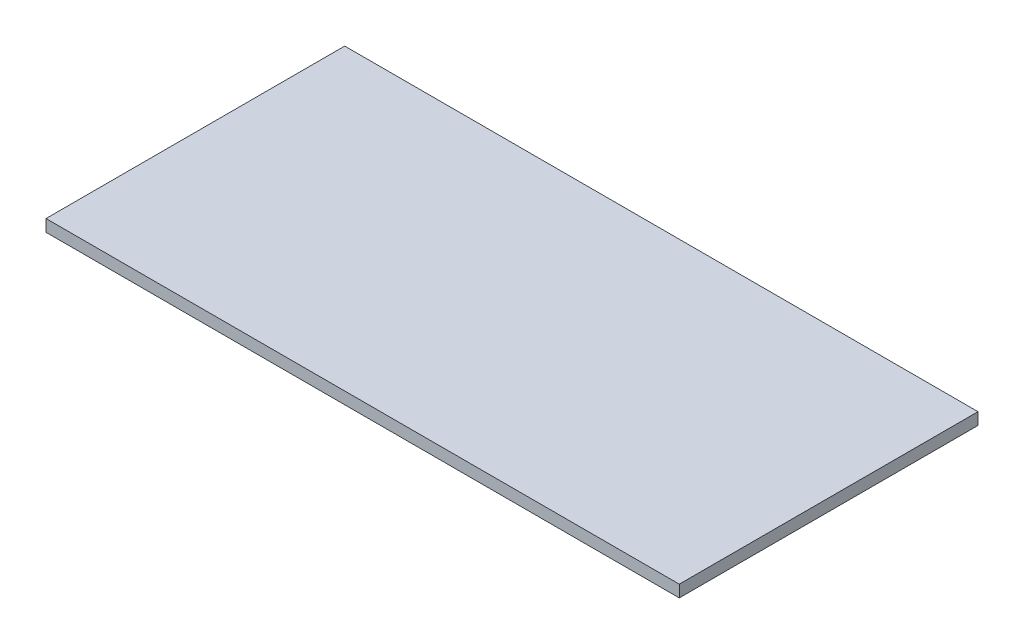
ISO-10303-21;
HEADER;
FILE_DESCRIPTION(('STEP AP214'),'2;1');
FILE_NAME('part.step','',(''),(''),'','','');
FILE_SCHEMA(('AUTOMOTIVE_DESIGN { 1 0 10303 214 1 1 1 1 }'));
ENDSEC;
DATA;
#1=APPLICATION_CONTEXT('core data for automotive mechanical design processes');
#2=APPLICATION_PROTOCOL_DEFINITION('international standard','automotive_design',2000,#1);
#3=PRODUCT_CONTEXT('',#1,'mechanical');
#4=PRODUCT('Part','Part','',(#3));
#5=PRODUCT_RELATED_PRODUCT_CATEGORY('part','',(#4));
#6=PRODUCT_DEFINITION_FORMATION('','',#4);
#7=PRODUCT_DEFINITION_CONTEXT('part definition',#1,'design');
#8=PRODUCT_DEFINITION('design','',#6,#7);
#9=PRODUCT_DEFINITION_SHAPE('','',#8);
#10=(LENGTH_UNIT() NAMED_UNIT(*) SI_UNIT(.MILLI.,.METRE.));
#11=(NAMED_UNIT(*) PLANE_ANGLE_UNIT() SI_UNIT($,.RADIAN.));
#12=(NAMED_UNIT(*) SI_UNIT($,.STERADIAN.) SOLID_ANGLE_UNIT());
#13=UNCERTAINTY_MEASURE_WITH_UNIT(LENGTH_MEASURE(1.E-05),#10,'distance_accuracy_value','');
#14=(GEOMETRIC_REPRESENTATION_CONTEXT(3) GLOBAL_UNCERTAINTY_ASSIGNED_CONTEXT((#13)) GLOBAL_UNIT_ASSIGNED_CONTEXT((#10,
#11,#12)) REPRESENTATION_CONTEXT('',''));
#15=CARTESIAN_POINT('',(0.,0.,0.));
#16=DIRECTION('',(0.,0.,1.));
#17=DIRECTION('',(1.,0.,0.));
#18=AXIS2_PLACEMENT_3D('',#15,#16,#17);
#19=CARTESIAN_POINT('',(-26.5,1.,0.));
#20=DIRECTION('',(1.,0.,0.));
#21=DIRECTION('',(0.,0.,-1.));
#22=AXIS2_PLACEMENT_3D('',#19,#20,#21);
#23=PLANE('',#22);
#24=DIRECTION('',(0.,0.,1.));
#25=VECTOR('',#24,1.);
#26=CARTESIAN_POINT('',(-26.5,0.,0.));
#27=LINE('',#26,#25);
#28=CARTESIAN_POINT('',(-26.5,0.,0.));
#29=VERTEX_POINT('',#28);
#30=CARTESIAN_POINT('',(-26.5,0.,25.));
#31=VERTEX_POINT('',#30);
#32=EDGE_CURVE('E96',#29,#31,#27,.T.);
#33=ORIENTED_EDGE('',*,*,#32,.T.);
#34=DIRECTION('',(0.,-1.,0.));
#35=VECTOR('',#34,1.);
#36=CARTESIAN_POINT('',(-26.5,1.,25.));
#37=LINE('',#36,#35);
#38=CARTESIAN_POINT('',(-26.5,1.,25.));
#39=VERTEX_POINT('',#38);
#40=EDGE_CURVE('E11',#39,#31,#37,.T.);
#41=ORIENTED_EDGE('',*,*,#40,.F.);
#42=DIRECTION('',(0.,0.,1.));
#43=VECTOR('',#42,1.);
#44=CARTESIAN_POINT('',(-26.5,1.,0.));
#45=LINE('',#44,#43);
#46=CARTESIAN_POINT('',(-26.5,1.,0.));
#47=VERTEX_POINT('',#46);
#48=EDGE_CURVE('E84',#47,#39,#45,.T.);
#49=ORIENTED_EDGE('',*,*,#48,.F.);
#50=DIRECTION('',(0.,-1.,0.));
#51=VECTOR('',#50,1.);
#52=CARTESIAN_POINT('',(-26.5,1.,0.));
#53=LINE('',#52,#51);
#54=EDGE_CURVE('E92',#47,#29,#53,.T.);
#55=ORIENTED_EDGE('',*,*,#54,.T.);
#56=EDGE_LOOP('',(#33,#41,#49,#55));
#57=FACE_BOUND('',#56,.T.);
#58=ADVANCED_FACE('F33',(#57),#23,.F.);
#59=CARTESIAN_POINT('',(-26.5,1.,25.));
#60=DIRECTION('',(0.,0.,-1.));
#61=DIRECTION('',(-1.,0.,0.));
#62=AXIS2_PLACEMENT_3D('',#59,#60,#61);
#63=PLANE('',#62);
#64=DIRECTION('',(1.,0.,0.));
#65=VECTOR('',#64,1.);
#66=CARTESIAN_POINT('',(-26.5,0.,25.));
#67=LINE('',#66,#65);
#68=CARTESIAN_POINT('',(26.5,0.,25.));
#69=VERTEX_POINT('',#68);
#70=EDGE_CURVE('E88',#31,#69,#67,.T.);
#71=ORIENTED_EDGE('',*,*,#70,.T.);
#72=DIRECTION('',(0.,-1.,0.));
#73=VECTOR('',#72,1.);
#74=CARTESIAN_POINT('',(26.5,1.,25.));
#75=LINE('',#74,#73);
#76=CARTESIAN_POINT('',(26.5,1.,25.));
#77=VERTEX_POINT('',#76);
#78=EDGE_CURVE('E41',#77,#69,#75,.T.);
#79=ORIENTED_EDGE('',*,*,#78,.F.);
#80=DIRECTION('',(1.,0.,0.));
#81=VECTOR('',#80,1.);
#82=CARTESIAN_POINT('',(-26.5,1.,25.));
#83=LINE('',#82,#81);
#84=EDGE_CURVE('E79',#39,#77,#83,.T.);
#85=ORIENTED_EDGE('',*,*,#84,.F.);
#86=ORIENTED_EDGE('',*,*,#40,.T.);
#87=EDGE_LOOP('',(#71,#79,#85,#86));
#88=FACE_BOUND('',#87,.T.);
#89=ADVANCED_FACE('F87',(#88),#63,.F.);
#90=CARTESIAN_POINT('',(26.5,1.,0.));
#91=DIRECTION('',(-1.,0.,0.));
#92=DIRECTION('',(0.,0.,1.));
#93=AXIS2_PLACEMENT_3D('',#90,#91,#92);
#94=PLANE('',#93);
#95=DIRECTION('',(0.,0.,-1.));
#96=VECTOR('',#95,1.);
#97=CARTESIAN_POINT('',(26.5,0.,0.));
#98=LINE('',#97,#96);
#99=CARTESIAN_POINT('',(26.5,0.,0.));
#100=VERTEX_POINT('',#99);
#101=EDGE_CURVE('E66',#69,#100,#98,.T.);
#102=ORIENTED_EDGE('',*,*,#101,.T.);
#103=DIRECTION('',(0.,-1.,0.));
#104=VECTOR('',#103,1.);
#105=CARTESIAN_POINT('',(26.5,1.,0.));
#106=LINE('',#105,#104);
#107=CARTESIAN_POINT('',(26.5,1.,0.));
#108=VERTEX_POINT('',#107);
#109=EDGE_CURVE('E89',#108,#100,#106,.T.);
#110=ORIENTED_EDGE('',*,*,#109,.F.);
#111=DIRECTION('',(0.,0.,-1.));
#112=VECTOR('',#111,1.);
#113=CARTESIAN_POINT('',(26.5,1.,0.));
#114=LINE('',#113,#112);
#115=EDGE_CURVE('E82',#77,#108,#114,.T.);
#116=ORIENTED_EDGE('',*,*,#115,.F.);
#117=ORIENTED_EDGE('',*,*,#78,.T.);
#118=EDGE_LOOP('',(#102,#110,#116,#117));
#119=FACE_BOUND('',#118,.T.);
#120=ADVANCED_FACE('F90',(#119),#94,.F.);
#121=CARTESIAN_POINT('',(-26.5,1.,0.));
#122=DIRECTION('',(0.,0.,1.));
#123=DIRECTION('',(1.,0.,0.));
#124=AXIS2_PLACEMENT_3D('',#121,#122,#123);
#125=PLANE('',#124);
#126=DIRECTION('',(-1.,0.,0.));
#127=VECTOR('',#126,1.);
#128=CARTESIAN_POINT('',(-26.5,0.,0.));
#129=LINE('',#128,#127);
#130=EDGE_CURVE('E72',#100,#29,#129,.T.);
#131=ORIENTED_EDGE('',*,*,#130,.T.);
#132=ORIENTED_EDGE('',*,*,#54,.F.);
#133=DIRECTION('',(-1.,0.,0.));
#134=VECTOR('',#133,1.);
#135=CARTESIAN_POINT('',(-26.5,1.,0.));
#136=LINE('',#135,#134);
#137=EDGE_CURVE('E49',#108,#47,#136,.T.);
#138=ORIENTED_EDGE('',*,*,#137,.F.);
#139=ORIENTED_EDGE('',*,*,#109,.T.);
#140=EDGE_LOOP('',(#131,#132,#138,#139));
#141=FACE_BOUND('',#140,.T.);
#142=ADVANCED_FACE('F103',(#141),#125,.F.);
#143=CARTESIAN_POINT('',(0.,1.,0.));
#144=DIRECTION('',(0.,1.,0.));
#145=DIRECTION('',(0.,0.,1.));
#146=AXIS2_PLACEMENT_3D('',#143,#144,#145);
#147=PLANE('',#146);
#148=ORIENTED_EDGE('',*,*,#48,.T.);
#149=ORIENTED_EDGE('',*,*,#84,.T.);
#150=ORIENTED_EDGE('',*,*,#115,.T.);
#151=ORIENTED_EDGE('',*,*,#137,.T.);
#152=EDGE_LOOP('',(#148,#149,#150,#151));
#153=FACE_BOUND('',#152,.T.);
#154=ADVANCED_FACE('F80',(#153),#147,.T.);
#155=CARTESIAN_POINT('',(0.,0.,0.));
#156=DIRECTION('',(0.,1.,0.));
#157=DIRECTION('',(0.,0.,1.));
#158=AXIS2_PLACEMENT_3D('',#155,#156,#157);
#159=PLANE('',#158);
#160=ORIENTED_EDGE('',*,*,#32,.F.);
#161=ORIENTED_EDGE('',*,*,#130,.F.);
#162=ORIENTED_EDGE('',*,*,#101,.F.);
#163=ORIENTED_EDGE('',*,*,#70,.F.);
#164=EDGE_LOOP('',(#160,#161,#162,#163));
#165=FACE_BOUND('',#164,.T.);
#166=ADVANCED_FACE('F106',(#165),#159,.F.);
#167=CLOSED_SHELL('',(#58,#89,#120,#142,#154,#166));
#168=MANIFOLD_SOLID_BREP('B2',#167);
#169=ADVANCED_BREP_SHAPE_REPRESENTATION('',(#18,#168),#14);
#170=SHAPE_DEFINITION_REPRESENTATION(#9,#169);
ENDSEC;
END-ISO-10303-21;
